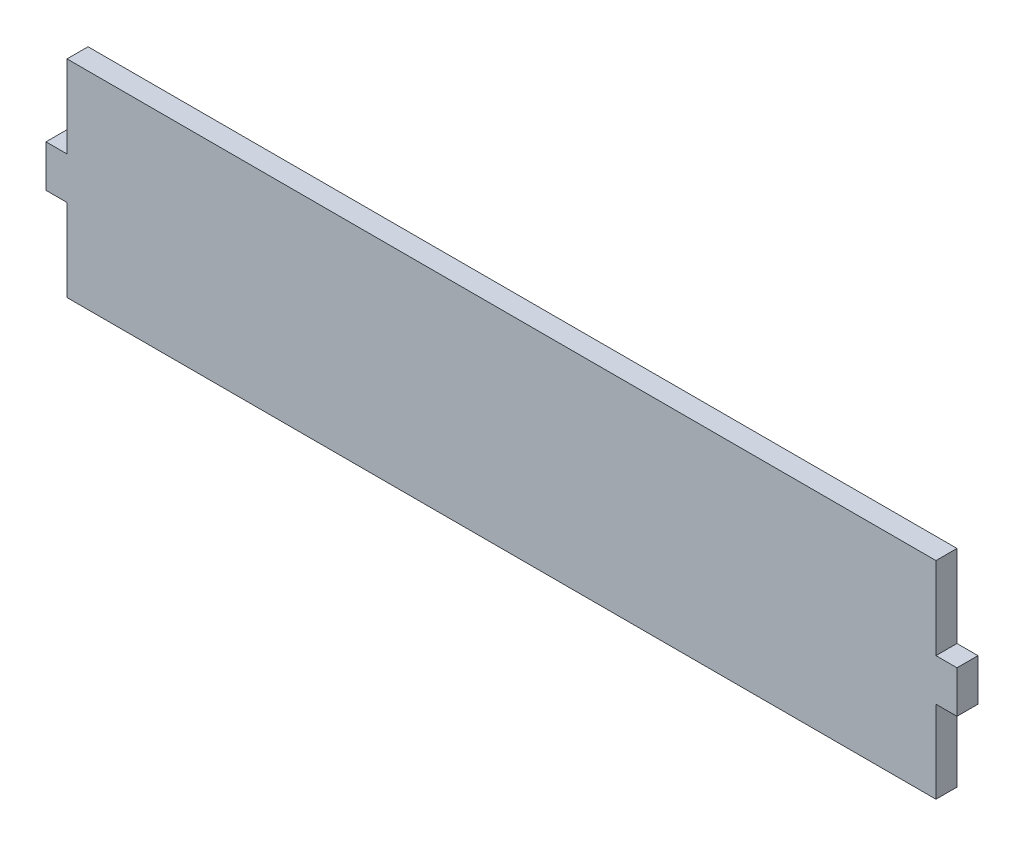
ISO-10303-21;
HEADER;
FILE_DESCRIPTION(('STEP AP214'),'2;1');
FILE_NAME('part.step','',(''),(''),'','','');
FILE_SCHEMA(('AUTOMOTIVE_DESIGN { 1 0 10303 214 1 1 1 1 }'));
ENDSEC;
DATA;
#1=APPLICATION_CONTEXT('core data for automotive mechanical design processes');
#2=APPLICATION_PROTOCOL_DEFINITION('international standard','automotive_design',2000,#1);
#3=PRODUCT_CONTEXT('',#1,'mechanical');
#4=PRODUCT('Part','Part','',(#3));
#5=PRODUCT_RELATED_PRODUCT_CATEGORY('part','',(#4));
#6=PRODUCT_DEFINITION_FORMATION('','',#4);
#7=PRODUCT_DEFINITION_CONTEXT('part definition',#1,'design');
#8=PRODUCT_DEFINITION('design','',#6,#7);
#9=PRODUCT_DEFINITION_SHAPE('','',#8);
#10=(LENGTH_UNIT() NAMED_UNIT(*) SI_UNIT(.MILLI.,.METRE.));
#11=(NAMED_UNIT(*) PLANE_ANGLE_UNIT() SI_UNIT($,.RADIAN.));
#12=(NAMED_UNIT(*) SI_UNIT($,.STERADIAN.) SOLID_ANGLE_UNIT());
#13=UNCERTAINTY_MEASURE_WITH_UNIT(LENGTH_MEASURE(1.E-05),#10,'distance_accuracy_value','');
#14=(GEOMETRIC_REPRESENTATION_CONTEXT(3) GLOBAL_UNCERTAINTY_ASSIGNED_CONTEXT((#13)) GLOBAL_UNIT_ASSIGNED_CONTEXT((#10,
#11,#12)) REPRESENTATION_CONTEXT('',''));
#15=CARTESIAN_POINT('',(0.,0.,0.));
#16=DIRECTION('',(0.,0.,1.));
#17=DIRECTION('',(1.,0.,0.));
#18=AXIS2_PLACEMENT_3D('',#15,#16,#17);
#19=CARTESIAN_POINT('',(0.,-29.5,-6.));
#20=DIRECTION('',(0.,-1.,0.));
#21=DIRECTION('',(0.,0.,-1.));
#22=AXIS2_PLACEMENT_3D('',#19,#20,#21);
#23=PLANE('',#22);
#24=DIRECTION('',(1.,0.,0.));
#25=VECTOR('',#24,1.);
#26=CARTESIAN_POINT('',(0.,-29.5,0.));
#27=LINE('',#26,#25);
#28=CARTESIAN_POINT('',(-124.,-29.5,0.));
#29=VERTEX_POINT('',#28);
#30=CARTESIAN_POINT('',(124.,-29.5,0.));
#31=VERTEX_POINT('',#30);
#32=EDGE_CURVE('E163',#29,#31,#27,.T.);
#33=ORIENTED_EDGE('',*,*,#32,.F.);
#34=DIRECTION('',(0.,0.,1.));
#35=VECTOR('',#34,1.);
#36=CARTESIAN_POINT('',(-124.,-29.5,-6.));
#37=LINE('',#36,#35);
#38=CARTESIAN_POINT('',(-124.,-29.5,-6.));
#39=VERTEX_POINT('',#38);
#40=EDGE_CURVE('E11',#39,#29,#37,.T.);
#41=ORIENTED_EDGE('',*,*,#40,.F.);
#42=DIRECTION('',(1.,0.,0.));
#43=VECTOR('',#42,1.);
#44=CARTESIAN_POINT('',(0.,-29.5,-6.));
#45=LINE('',#44,#43);
#46=CARTESIAN_POINT('',(124.,-29.5,-6.));
#47=VERTEX_POINT('',#46);
#48=EDGE_CURVE('E192',#39,#47,#45,.T.);
#49=ORIENTED_EDGE('',*,*,#48,.T.);
#50=DIRECTION('',(0.,0.,1.));
#51=VECTOR('',#50,1.);
#52=CARTESIAN_POINT('',(124.,-29.5,-6.));
#53=LINE('',#52,#51);
#54=EDGE_CURVE('E44',#47,#31,#53,.T.);
#55=ORIENTED_EDGE('',*,*,#54,.T.);
#56=EDGE_LOOP('',(#33,#41,#49,#55));
#57=FACE_BOUND('',#56,.T.);
#58=ADVANCED_FACE('F41',(#57),#23,.T.);
#59=CARTESIAN_POINT('',(-124.,0.,-6.));
#60=DIRECTION('',(1.,0.,0.));
#61=DIRECTION('',(0.,0.,-1.));
#62=AXIS2_PLACEMENT_3D('',#59,#60,#61);
#63=PLANE('',#62);
#64=DIRECTION('',(0.,1.,0.));
#65=VECTOR('',#64,1.);
#66=CARTESIAN_POINT('',(-124.,0.,0.));
#67=LINE('',#66,#65);
#68=CARTESIAN_POINT('',(-124.,-6.,0.));
#69=VERTEX_POINT('',#68);
#70=EDGE_CURVE('E98',#29,#69,#67,.T.);
#71=ORIENTED_EDGE('',*,*,#70,.T.);
#72=DIRECTION('',(0.,0.,1.));
#73=VECTOR('',#72,1.);
#74=CARTESIAN_POINT('',(-124.,-6.,-6.));
#75=LINE('',#74,#73);
#76=CARTESIAN_POINT('',(-124.,-6.,-6.));
#77=VERTEX_POINT('',#76);
#78=EDGE_CURVE('E50',#77,#69,#75,.T.);
#79=ORIENTED_EDGE('',*,*,#78,.F.);
#80=DIRECTION('',(0.,1.,0.));
#81=VECTOR('',#80,1.);
#82=CARTESIAN_POINT('',(-124.,0.,-6.));
#83=LINE('',#82,#81);
#84=EDGE_CURVE('E141',#39,#77,#83,.T.);
#85=ORIENTED_EDGE('',*,*,#84,.F.);
#86=ORIENTED_EDGE('',*,*,#40,.T.);
#87=EDGE_LOOP('',(#71,#79,#85,#86));
#88=FACE_BOUND('',#87,.T.);
#89=ADVANCED_FACE('F268',(#88),#63,.F.);
#90=CARTESIAN_POINT('',(0.,-5.99999999999998,-6.));
#91=DIRECTION('',(0.,1.,0.));
#92=DIRECTION('',(-1.,0.,0.));
#93=AXIS2_PLACEMENT_3D('',#90,#91,#92);
#94=PLANE('',#93);
#95=DIRECTION('',(-1.,0.,0.));
#96=VECTOR('',#95,1.);
#97=CARTESIAN_POINT('',(0.,-5.99999999999998,0.));
#98=LINE('',#97,#96);
#99=CARTESIAN_POINT('',(-130.,-6.,0.));
#100=VERTEX_POINT('',#99);
#101=EDGE_CURVE('E148',#69,#100,#98,.T.);
#102=ORIENTED_EDGE('',*,*,#101,.T.);
#103=DIRECTION('',(0.,0.,1.));
#104=VECTOR('',#103,1.);
#105=CARTESIAN_POINT('',(-130.,-6.,-6.));
#106=LINE('',#105,#104);
#107=CARTESIAN_POINT('',(-130.,-6.,-6.));
#108=VERTEX_POINT('',#107);
#109=EDGE_CURVE('E145',#108,#100,#106,.T.);
#110=ORIENTED_EDGE('',*,*,#109,.F.);
#111=DIRECTION('',(-1.,0.,0.));
#112=VECTOR('',#111,1.);
#113=CARTESIAN_POINT('',(0.,-5.99999999999998,-6.));
#114=LINE('',#113,#112);
#115=EDGE_CURVE('E134',#77,#108,#114,.T.);
#116=ORIENTED_EDGE('',*,*,#115,.F.);
#117=ORIENTED_EDGE('',*,*,#78,.T.);
#118=EDGE_LOOP('',(#102,#110,#116,#117));
#119=FACE_BOUND('',#118,.T.);
#120=ADVANCED_FACE('F146',(#119),#94,.F.);
#121=CARTESIAN_POINT('',(-130.,0.,-6.));
#122=DIRECTION('',(1.,0.,0.));
#123=DIRECTION('',(0.,0.,-1.));
#124=AXIS2_PLACEMENT_3D('',#121,#122,#123);
#125=PLANE('',#124);
#126=DIRECTION('',(0.,1.,0.));
#127=VECTOR('',#126,1.);
#128=CARTESIAN_POINT('',(-130.,0.,0.));
#129=LINE('',#128,#127);
#130=CARTESIAN_POINT('',(-130.,6.,0.));
#131=VERTEX_POINT('',#130);
#132=EDGE_CURVE('E189',#100,#131,#129,.T.);
#133=ORIENTED_EDGE('',*,*,#132,.T.);
#134=DIRECTION('',(0.,0.,1.));
#135=VECTOR('',#134,1.);
#136=CARTESIAN_POINT('',(-130.,6.,-6.));
#137=LINE('',#136,#135);
#138=CARTESIAN_POINT('',(-130.,6.,-6.));
#139=VERTEX_POINT('',#138);
#140=EDGE_CURVE('E151',#139,#131,#137,.T.);
#141=ORIENTED_EDGE('',*,*,#140,.F.);
#142=DIRECTION('',(0.,1.,0.));
#143=VECTOR('',#142,1.);
#144=CARTESIAN_POINT('',(-130.,0.,-6.));
#145=LINE('',#144,#143);
#146=EDGE_CURVE('E139',#108,#139,#145,.T.);
#147=ORIENTED_EDGE('',*,*,#146,.F.);
#148=ORIENTED_EDGE('',*,*,#109,.T.);
#149=EDGE_LOOP('',(#133,#141,#147,#148));
#150=FACE_BOUND('',#149,.T.);
#151=ADVANCED_FACE('F153',(#150),#125,.F.);
#152=CARTESIAN_POINT('',(0.,6.,-6.));
#153=DIRECTION('',(0.,-1.,0.));
#154=DIRECTION('',(0.,0.,-1.));
#155=AXIS2_PLACEMENT_3D('',#152,#153,#154);
#156=PLANE('',#155);
#157=DIRECTION('',(1.,0.,0.));
#158=VECTOR('',#157,1.);
#159=CARTESIAN_POINT('',(0.,6.,0.));
#160=LINE('',#159,#158);
#161=CARTESIAN_POINT('',(-124.,6.,0.));
#162=VERTEX_POINT('',#161);
#163=EDGE_CURVE('E186',#131,#162,#160,.T.);
#164=ORIENTED_EDGE('',*,*,#163,.T.);
#165=DIRECTION('',(0.,0.,1.));
#166=VECTOR('',#165,1.);
#167=CARTESIAN_POINT('',(-124.,6.,-6.));
#168=LINE('',#167,#166);
#169=CARTESIAN_POINT('',(-124.,6.,-6.));
#170=VERTEX_POINT('',#169);
#171=EDGE_CURVE('E196',#170,#162,#168,.T.);
#172=ORIENTED_EDGE('',*,*,#171,.F.);
#173=DIRECTION('',(1.,0.,0.));
#174=VECTOR('',#173,1.);
#175=CARTESIAN_POINT('',(0.,6.,-6.));
#176=LINE('',#175,#174);
#177=EDGE_CURVE('E156',#139,#170,#176,.T.);
#178=ORIENTED_EDGE('',*,*,#177,.F.);
#179=ORIENTED_EDGE('',*,*,#140,.T.);
#180=EDGE_LOOP('',(#164,#172,#178,#179));
#181=FACE_BOUND('',#180,.T.);
#182=ADVANCED_FACE('F216',(#181),#156,.F.);
#183=CARTESIAN_POINT('',(-124.,0.,-6.));
#184=DIRECTION('',(-1.,0.,0.));
#185=DIRECTION('',(0.,0.,1.));
#186=AXIS2_PLACEMENT_3D('',#183,#184,#185);
#187=PLANE('',#186);
#188=DIRECTION('',(0.,-1.,0.));
#189=VECTOR('',#188,1.);
#190=CARTESIAN_POINT('',(-124.,0.,0.));
#191=LINE('',#190,#189);
#192=CARTESIAN_POINT('',(-124.,29.5,0.));
#193=VERTEX_POINT('',#192);
#194=EDGE_CURVE('E183',#193,#162,#191,.T.);
#195=ORIENTED_EDGE('',*,*,#194,.F.);
#196=DIRECTION('',(0.,0.,1.));
#197=VECTOR('',#196,1.);
#198=CARTESIAN_POINT('',(-124.,29.5,-6.));
#199=LINE('',#198,#197);
#200=CARTESIAN_POINT('',(-124.,29.5,-6.));
#201=VERTEX_POINT('',#200);
#202=EDGE_CURVE('E198',#201,#193,#199,.T.);
#203=ORIENTED_EDGE('',*,*,#202,.F.);
#204=DIRECTION('',(0.,-1.,0.));
#205=VECTOR('',#204,1.);
#206=CARTESIAN_POINT('',(-124.,0.,-6.));
#207=LINE('',#206,#205);
#208=EDGE_CURVE('E158',#201,#170,#207,.T.);
#209=ORIENTED_EDGE('',*,*,#208,.T.);
#210=ORIENTED_EDGE('',*,*,#171,.T.);
#211=EDGE_LOOP('',(#195,#203,#209,#210));
#212=FACE_BOUND('',#211,.T.);
#213=ADVANCED_FACE('F258',(#212),#187,.T.);
#214=CARTESIAN_POINT('',(0.,29.5,-6.));
#215=DIRECTION('',(0.,-1.,0.));
#216=DIRECTION('',(0.,0.,-1.));
#217=AXIS2_PLACEMENT_3D('',#214,#215,#216);
#218=PLANE('',#217);
#219=DIRECTION('',(1.,0.,0.));
#220=VECTOR('',#219,1.);
#221=CARTESIAN_POINT('',(0.,29.5,0.));
#222=LINE('',#221,#220);
#223=CARTESIAN_POINT('',(124.,29.5,0.));
#224=VERTEX_POINT('',#223);
#225=EDGE_CURVE('E181',#193,#224,#222,.T.);
#226=ORIENTED_EDGE('',*,*,#225,.T.);
#227=DIRECTION('',(0.,0.,1.));
#228=VECTOR('',#227,1.);
#229=CARTESIAN_POINT('',(124.,29.5,-6.));
#230=LINE('',#229,#228);
#231=CARTESIAN_POINT('',(124.,29.5,-6.));
#232=VERTEX_POINT('',#231);
#233=EDGE_CURVE('E200',#232,#224,#230,.T.);
#234=ORIENTED_EDGE('',*,*,#233,.F.);
#235=DIRECTION('',(1.,0.,0.));
#236=VECTOR('',#235,1.);
#237=CARTESIAN_POINT('',(0.,29.5,-6.));
#238=LINE('',#237,#236);
#239=EDGE_CURVE('E221',#201,#232,#238,.T.);
#240=ORIENTED_EDGE('',*,*,#239,.F.);
#241=ORIENTED_EDGE('',*,*,#202,.T.);
#242=EDGE_LOOP('',(#226,#234,#240,#241));
#243=FACE_BOUND('',#242,.T.);
#244=ADVANCED_FACE('F257',(#243),#218,.F.);
#245=CARTESIAN_POINT('',(124.,0.,-6.));
#246=DIRECTION('',(-1.,0.,0.));
#247=DIRECTION('',(0.,0.,1.));
#248=AXIS2_PLACEMENT_3D('',#245,#246,#247);
#249=PLANE('',#248);
#250=DIRECTION('',(0.,-1.,0.));
#251=VECTOR('',#250,1.);
#252=CARTESIAN_POINT('',(124.,0.,0.));
#253=LINE('',#252,#251);
#254=CARTESIAN_POINT('',(124.,6.,0.));
#255=VERTEX_POINT('',#254);
#256=EDGE_CURVE('E178',#224,#255,#253,.T.);
#257=ORIENTED_EDGE('',*,*,#256,.T.);
#258=DIRECTION('',(0.,0.,1.));
#259=VECTOR('',#258,1.);
#260=CARTESIAN_POINT('',(124.,6.,-6.));
#261=LINE('',#260,#259);
#262=CARTESIAN_POINT('',(124.,6.,-6.));
#263=VERTEX_POINT('',#262);
#264=EDGE_CURVE('E203',#263,#255,#261,.T.);
#265=ORIENTED_EDGE('',*,*,#264,.F.);
#266=DIRECTION('',(0.,-1.,0.));
#267=VECTOR('',#266,1.);
#268=CARTESIAN_POINT('',(124.,0.,-6.));
#269=LINE('',#268,#267);
#270=EDGE_CURVE('E224',#232,#263,#269,.T.);
#271=ORIENTED_EDGE('',*,*,#270,.F.);
#272=ORIENTED_EDGE('',*,*,#233,.T.);
#273=EDGE_LOOP('',(#257,#265,#271,#272));
#274=FACE_BOUND('',#273,.T.);
#275=ADVANCED_FACE('F254',(#274),#249,.F.);
#276=CARTESIAN_POINT('',(0.,5.99999999999992,-6.));
#277=DIRECTION('',(0.,1.,0.));
#278=DIRECTION('',(-1.,0.,0.));
#279=AXIS2_PLACEMENT_3D('',#276,#277,#278);
#280=PLANE('',#279);
#281=DIRECTION('',(-1.,0.,0.));
#282=VECTOR('',#281,1.);
#283=CARTESIAN_POINT('',(0.,5.99999999999992,0.));
#284=LINE('',#283,#282);
#285=CARTESIAN_POINT('',(130.,6.,0.));
#286=VERTEX_POINT('',#285);
#287=EDGE_CURVE('E175',#286,#255,#284,.T.);
#288=ORIENTED_EDGE('',*,*,#287,.F.);
#289=DIRECTION('',(0.,0.,1.));
#290=VECTOR('',#289,1.);
#291=CARTESIAN_POINT('',(130.,6.,-6.));
#292=LINE('',#291,#290);
#293=CARTESIAN_POINT('',(130.,6.,-6.));
#294=VERTEX_POINT('',#293);
#295=EDGE_CURVE('E205',#294,#286,#292,.T.);
#296=ORIENTED_EDGE('',*,*,#295,.F.);
#297=DIRECTION('',(-1.,0.,0.));
#298=VECTOR('',#297,1.);
#299=CARTESIAN_POINT('',(0.,5.99999999999992,-6.));
#300=LINE('',#299,#298);
#301=EDGE_CURVE('E228',#294,#263,#300,.T.);
#302=ORIENTED_EDGE('',*,*,#301,.T.);
#303=ORIENTED_EDGE('',*,*,#264,.T.);
#304=EDGE_LOOP('',(#288,#296,#302,#303));
#305=FACE_BOUND('',#304,.T.);
#306=ADVANCED_FACE('F248',(#305),#280,.T.);
#307=CARTESIAN_POINT('',(130.,0.,-6.));
#308=DIRECTION('',(1.,0.,0.));
#309=DIRECTION('',(0.,0.,-1.));
#310=AXIS2_PLACEMENT_3D('',#307,#308,#309);
#311=PLANE('',#310);
#312=DIRECTION('',(0.,1.,0.));
#313=VECTOR('',#312,1.);
#314=CARTESIAN_POINT('',(130.,0.,0.));
#315=LINE('',#314,#313);
#316=CARTESIAN_POINT('',(130.,-6.,0.));
#317=VERTEX_POINT('',#316);
#318=EDGE_CURVE('E172',#317,#286,#315,.T.);
#319=ORIENTED_EDGE('',*,*,#318,.F.);
#320=DIRECTION('',(0.,0.,1.));
#321=VECTOR('',#320,1.);
#322=CARTESIAN_POINT('',(130.,-6.,-6.));
#323=LINE('',#322,#321);
#324=CARTESIAN_POINT('',(130.,-6.,-6.));
#325=VERTEX_POINT('',#324);
#326=EDGE_CURVE('E207',#325,#317,#323,.T.);
#327=ORIENTED_EDGE('',*,*,#326,.F.);
#328=DIRECTION('',(0.,1.,0.));
#329=VECTOR('',#328,1.);
#330=CARTESIAN_POINT('',(130.,0.,-6.));
#331=LINE('',#330,#329);
#332=EDGE_CURVE('E231',#325,#294,#331,.T.);
#333=ORIENTED_EDGE('',*,*,#332,.T.);
#334=ORIENTED_EDGE('',*,*,#295,.T.);
#335=EDGE_LOOP('',(#319,#327,#333,#334));
#336=FACE_BOUND('',#335,.T.);
#337=ADVANCED_FACE('F245',(#336),#311,.T.);
#338=CARTESIAN_POINT('',(0.,-6.00000000000006,-6.));
#339=DIRECTION('',(0.,1.,0.));
#340=DIRECTION('',(-1.,0.,0.));
#341=AXIS2_PLACEMENT_3D('',#338,#339,#340);
#342=PLANE('',#341);
#343=DIRECTION('',(-1.,0.,0.));
#344=VECTOR('',#343,1.);
#345=CARTESIAN_POINT('',(0.,-6.00000000000006,0.));
#346=LINE('',#345,#344);
#347=CARTESIAN_POINT('',(124.,-6.,0.));
#348=VERTEX_POINT('',#347);
#349=EDGE_CURVE('E169',#317,#348,#346,.T.);
#350=ORIENTED_EDGE('',*,*,#349,.T.);
#351=DIRECTION('',(0.,0.,1.));
#352=VECTOR('',#351,1.);
#353=CARTESIAN_POINT('',(124.,-6.,-6.));
#354=LINE('',#353,#352);
#355=CARTESIAN_POINT('',(124.,-6.,-6.));
#356=VERTEX_POINT('',#355);
#357=EDGE_CURVE('E208',#356,#348,#354,.T.);
#358=ORIENTED_EDGE('',*,*,#357,.F.);
#359=DIRECTION('',(-1.,0.,0.));
#360=VECTOR('',#359,1.);
#361=CARTESIAN_POINT('',(0.,-6.00000000000006,-6.));
#362=LINE('',#361,#360);
#363=EDGE_CURVE('E234',#325,#356,#362,.T.);
#364=ORIENTED_EDGE('',*,*,#363,.F.);
#365=ORIENTED_EDGE('',*,*,#326,.T.);
#366=EDGE_LOOP('',(#350,#358,#364,#365));
#367=FACE_BOUND('',#366,.T.);
#368=ADVANCED_FACE('F242',(#367),#342,.F.);
#369=CARTESIAN_POINT('',(124.,0.,-6.));
#370=DIRECTION('',(1.,0.,0.));
#371=DIRECTION('',(0.,0.,-1.));
#372=AXIS2_PLACEMENT_3D('',#369,#370,#371);
#373=PLANE('',#372);
#374=DIRECTION('',(0.,1.,0.));
#375=VECTOR('',#374,1.);
#376=CARTESIAN_POINT('',(124.,0.,0.));
#377=LINE('',#376,#375);
#378=EDGE_CURVE('E166',#31,#348,#377,.T.);
#379=ORIENTED_EDGE('',*,*,#378,.F.);
#380=ORIENTED_EDGE('',*,*,#54,.F.);
#381=DIRECTION('',(0.,1.,0.));
#382=VECTOR('',#381,1.);
#383=CARTESIAN_POINT('',(124.,0.,-6.));
#384=LINE('',#383,#382);
#385=EDGE_CURVE('E236',#47,#356,#384,.T.);
#386=ORIENTED_EDGE('',*,*,#385,.T.);
#387=ORIENTED_EDGE('',*,*,#357,.T.);
#388=EDGE_LOOP('',(#379,#380,#386,#387));
#389=FACE_BOUND('',#388,.T.);
#390=ADVANCED_FACE('F210',(#389),#373,.T.);
#391=CARTESIAN_POINT('',(0.,0.,-6.));
#392=DIRECTION('',(0.,0.,1.));
#393=DIRECTION('',(1.,0.,0.));
#394=AXIS2_PLACEMENT_3D('',#391,#392,#393);
#395=PLANE('',#394);
#396=ORIENTED_EDGE('',*,*,#48,.F.);
#397=ORIENTED_EDGE('',*,*,#84,.T.);
#398=ORIENTED_EDGE('',*,*,#115,.T.);
#399=ORIENTED_EDGE('',*,*,#146,.T.);
#400=ORIENTED_EDGE('',*,*,#177,.T.);
#401=ORIENTED_EDGE('',*,*,#208,.F.);
#402=ORIENTED_EDGE('',*,*,#239,.T.);
#403=ORIENTED_EDGE('',*,*,#270,.T.);
#404=ORIENTED_EDGE('',*,*,#301,.F.);
#405=ORIENTED_EDGE('',*,*,#332,.F.);
#406=ORIENTED_EDGE('',*,*,#363,.T.);
#407=ORIENTED_EDGE('',*,*,#385,.F.);
#408=EDGE_LOOP('',(#396,#397,#398,#399,#400,#401,#402,#403,#404,#405,#406,#407));
#409=FACE_BOUND('',#408,.T.);
#410=ADVANCED_FACE('F137',(#409),#395,.F.);
#411=CARTESIAN_POINT('',(0.,0.,0.));
#412=DIRECTION('',(0.,0.,1.));
#413=DIRECTION('',(1.,0.,0.));
#414=AXIS2_PLACEMENT_3D('',#411,#412,#413);
#415=PLANE('',#414);
#416=ORIENTED_EDGE('',*,*,#32,.T.);
#417=ORIENTED_EDGE('',*,*,#378,.T.);
#418=ORIENTED_EDGE('',*,*,#349,.F.);
#419=ORIENTED_EDGE('',*,*,#318,.T.);
#420=ORIENTED_EDGE('',*,*,#287,.T.);
#421=ORIENTED_EDGE('',*,*,#256,.F.);
#422=ORIENTED_EDGE('',*,*,#225,.F.);
#423=ORIENTED_EDGE('',*,*,#194,.T.);
#424=ORIENTED_EDGE('',*,*,#163,.F.);
#425=ORIENTED_EDGE('',*,*,#132,.F.);
#426=ORIENTED_EDGE('',*,*,#101,.F.);
#427=ORIENTED_EDGE('',*,*,#70,.F.);
#428=EDGE_LOOP('',(#416,#417,#418,#419,#420,#421,#422,#423,#424,#425,#426,#427));
#429=FACE_BOUND('',#428,.T.);
#430=ADVANCED_FACE('F213',(#429),#415,.T.);
#431=CLOSED_SHELL('',(#58,#89,#120,#151,#182,#213,#244,#275,#306,#337,#368,#390,#410,#430));
#432=MANIFOLD_SOLID_BREP('B2',#431);
#433=ADVANCED_BREP_SHAPE_REPRESENTATION('',(#18,#432),#14);
#434=SHAPE_DEFINITION_REPRESENTATION(#9,#433);
ENDSEC;
END-ISO-10303-21;
